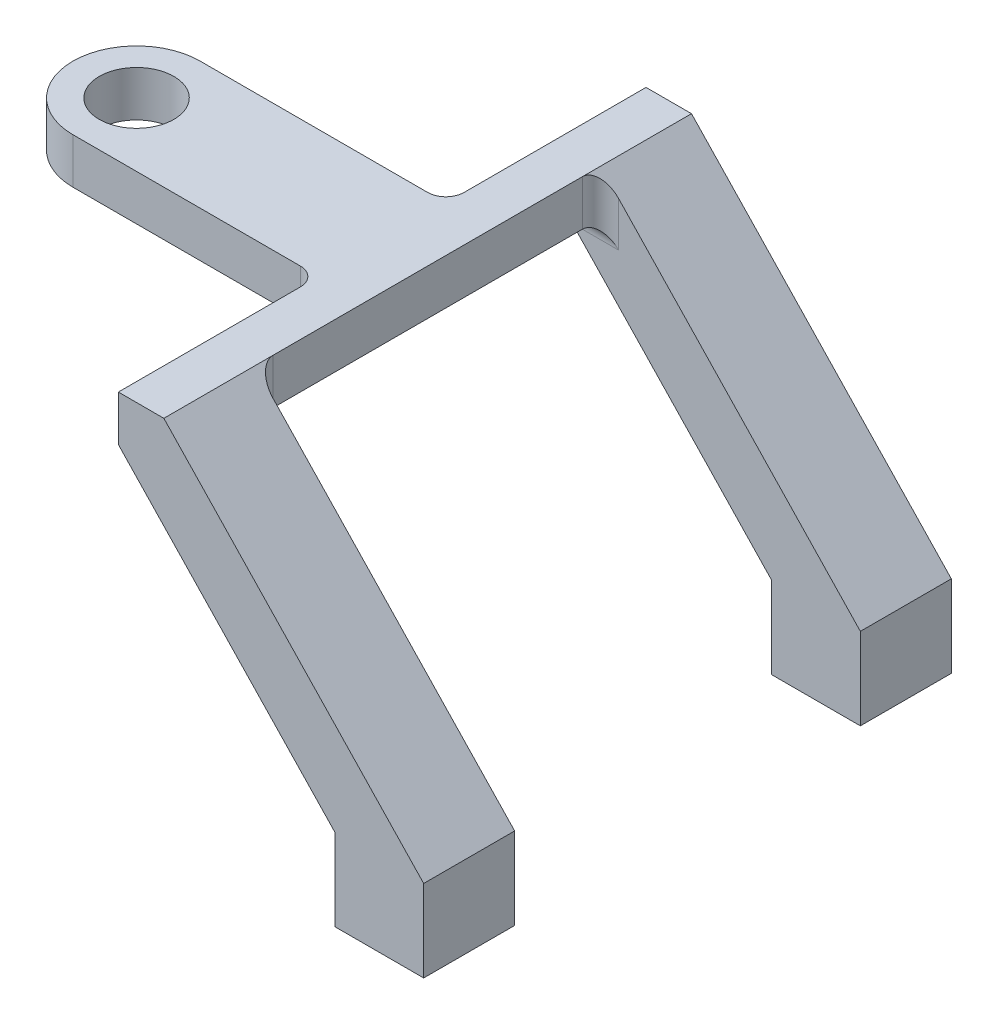
ISO-10303-21;
HEADER;
FILE_DESCRIPTION(('STEP AP214'),'2;1');
FILE_NAME('part.step','',(''),(''),'','','');
FILE_SCHEMA(('AUTOMOTIVE_DESIGN { 1 0 10303 214 1 1 1 1 }'));
ENDSEC;
DATA;
#1=APPLICATION_CONTEXT('core data for automotive mechanical design processes');
#2=APPLICATION_PROTOCOL_DEFINITION('international standard','automotive_design',2000,#1);
#3=PRODUCT_CONTEXT('',#1,'mechanical');
#4=PRODUCT('Part','Part','',(#3));
#5=PRODUCT_RELATED_PRODUCT_CATEGORY('part','',(#4));
#6=PRODUCT_DEFINITION_FORMATION('','',#4);
#7=PRODUCT_DEFINITION_CONTEXT('part definition',#1,'design');
#8=PRODUCT_DEFINITION('design','',#6,#7);
#9=PRODUCT_DEFINITION_SHAPE('','',#8);
#10=(LENGTH_UNIT() NAMED_UNIT(*) SI_UNIT(.MILLI.,.METRE.));
#11=(NAMED_UNIT(*) PLANE_ANGLE_UNIT() SI_UNIT($,.RADIAN.));
#12=(NAMED_UNIT(*) SI_UNIT($,.STERADIAN.) SOLID_ANGLE_UNIT());
#13=UNCERTAINTY_MEASURE_WITH_UNIT(LENGTH_MEASURE(1.E-05),#10,'distance_accuracy_value','');
#14=(GEOMETRIC_REPRESENTATION_CONTEXT(3) GLOBAL_UNCERTAINTY_ASSIGNED_CONTEXT((#13)) GLOBAL_UNIT_ASSIGNED_CONTEXT((#10,
#11,#12)) REPRESENTATION_CONTEXT('',''));
#15=CARTESIAN_POINT('',(0.,0.,0.));
#16=DIRECTION('',(0.,0.,1.));
#17=DIRECTION('',(1.,0.,0.));
#18=AXIS2_PLACEMENT_3D('',#15,#16,#17);
#19=CARTESIAN_POINT('',(-42.6212,43.18,12.7));
#20=DIRECTION('',(1.,0.,0.));
#21=DIRECTION('',(0.,0.,-1.));
#22=AXIS2_PLACEMENT_3D('',#19,#20,#21);
#23=PLANE('',#22);
#24=DIRECTION('',(0.,0.,-1.));
#25=VECTOR('',#24,1.);
#26=CARTESIAN_POINT('',(-42.6212,49.53,12.7));
#27=LINE('',#26,#25);
#28=CARTESIAN_POINT('',(-42.6212,49.53,73.66));
#29=VERTEX_POINT('',#28);
#30=CARTESIAN_POINT('',(-42.6212,49.53,48.26));
#31=VERTEX_POINT('',#30);
#32=EDGE_CURVE('E427',#29,#31,#27,.T.);
#33=ORIENTED_EDGE('',*,*,#32,.T.);
#34=DIRECTION('',(0.,1.,0.));
#35=VECTOR('',#34,1.);
#36=CARTESIAN_POINT('',(-42.6212,43.18,48.26));
#37=LINE('',#36,#35);
#38=CARTESIAN_POINT('',(-42.6212,43.18,48.26));
#39=VERTEX_POINT('',#38);
#40=EDGE_CURVE('E458',#31,#39,#37,.F.);
#41=ORIENTED_EDGE('',*,*,#40,.T.);
#42=DIRECTION('',(0.,0.,-1.));
#43=VECTOR('',#42,1.);
#44=CARTESIAN_POINT('',(-42.6212,43.18,60.96));
#45=LINE('',#44,#43);
#46=CARTESIAN_POINT('',(-42.6212,43.18,58.42));
#47=VERTEX_POINT('',#46);
#48=EDGE_CURVE('E372',#47,#39,#45,.T.);
#49=ORIENTED_EDGE('',*,*,#48,.F.);
#50=DIRECTION('',(0.,0.,-1.));
#51=VECTOR('',#50,1.);
#52=CARTESIAN_POINT('',(-42.6212,43.18,73.66));
#53=LINE('',#52,#51);
#54=CARTESIAN_POINT('',(-42.6212,43.18,73.66));
#55=VERTEX_POINT('',#54);
#56=EDGE_CURVE('E81',#55,#47,#53,.T.);
#57=ORIENTED_EDGE('',*,*,#56,.F.);
#58=DIRECTION('',(0.,-1.,0.));
#59=VECTOR('',#58,1.);
#60=CARTESIAN_POINT('',(-42.6212,49.53,73.66));
#61=LINE('',#60,#59);
#62=EDGE_CURVE('E304',#29,#55,#61,.T.);
#63=ORIENTED_EDGE('',*,*,#62,.F.);
#64=EDGE_LOOP('',(#33,#41,#49,#57,#63));
#65=FACE_BOUND('',#64,.T.);
#66=ADVANCED_FACE('F39',(#65),#23,.F.);
#67=CARTESIAN_POINT('',(0.,0.,12.7));
#68=DIRECTION('',(0.,0.,-1.));
#69=DIRECTION('',(-1.,0.,0.));
#70=AXIS2_PLACEMENT_3D('',#67,#68,#69);
#71=PLANE('',#70);
#72=DIRECTION('',(-0.689510475747819,0.724275709819138,0.));
#73=VECTOR('',#72,1.);
#74=CARTESIAN_POINT('',(-36.2712,49.53,12.7));
#75=LINE('',#74,#73);
#76=CARTESIAN_POINT('',(0.,11.43,12.7));
#77=VERTEX_POINT('',#76);
#78=CARTESIAN_POINT('',(-33.7312,46.8619327731092,12.7));
#79=VERTEX_POINT('',#78);
#80=EDGE_CURVE('E377',#77,#79,#75,.T.);
#81=ORIENTED_EDGE('',*,*,#80,.T.);
#82=DIRECTION('',(0.,1.,0.));
#83=VECTOR('',#82,1.);
#84=CARTESIAN_POINT('',(-33.7312,43.18,12.7));
#85=LINE('',#84,#83);
#86=CARTESIAN_POINT('',(-33.7312,40.64,12.7));
#87=VERTEX_POINT('',#86);
#88=EDGE_CURVE('E448',#79,#87,#85,.F.);
#89=ORIENTED_EDGE('',*,*,#88,.T.);
#90=DIRECTION('',(1.,0.,0.));
#91=VECTOR('',#90,1.);
#92=CARTESIAN_POINT('',(-42.6212,40.64,12.7));
#93=LINE('',#92,#91);
#94=CARTESIAN_POINT('',(-40.20312,40.64,12.7));
#95=VERTEX_POINT('',#94);
#96=EDGE_CURVE('E445',#87,#95,#93,.F.);
#97=ORIENTED_EDGE('',*,*,#96,.T.);
#98=DIRECTION('',(0.689510475747819,-0.724275709819138,0.));
#99=VECTOR('',#98,1.);
#100=CARTESIAN_POINT('',(-12.3952,11.43,12.7));
#101=LINE('',#100,#99);
#102=CARTESIAN_POINT('',(-12.3952,11.43,12.7));
#103=VERTEX_POINT('',#102);
#104=EDGE_CURVE('E382',#95,#103,#101,.T.);
#105=ORIENTED_EDGE('',*,*,#104,.T.);
#106=DIRECTION('',(0.,-1.,0.));
#107=VECTOR('',#106,1.);
#108=CARTESIAN_POINT('',(-12.3952,0.,12.7));
#109=LINE('',#108,#107);
#110=CARTESIAN_POINT('',(-12.3952,0.,12.7));
#111=VERTEX_POINT('',#110);
#112=EDGE_CURVE('E385',#103,#111,#109,.T.);
#113=ORIENTED_EDGE('',*,*,#112,.T.);
#114=DIRECTION('',(1.,0.,0.));
#115=VECTOR('',#114,1.);
#116=CARTESIAN_POINT('',(0.,0.,12.7));
#117=LINE('',#116,#115);
#118=CARTESIAN_POINT('',(0.,0.,12.7));
#119=VERTEX_POINT('',#118);
#120=EDGE_CURVE('E388',#111,#119,#117,.T.);
#121=ORIENTED_EDGE('',*,*,#120,.T.);
#122=DIRECTION('',(0.,1.,0.));
#123=VECTOR('',#122,1.);
#124=CARTESIAN_POINT('',(0.,11.43,12.7));
#125=LINE('',#124,#123);
#126=EDGE_CURVE('E373',#119,#77,#125,.T.);
#127=ORIENTED_EDGE('',*,*,#126,.T.);
#128=EDGE_LOOP('',(#81,#89,#97,#105,#113,#121,#127));
#129=FACE_BOUND('',#128,.T.);
#130=ADVANCED_FACE('F493',(#129),#71,.F.);
#131=CARTESIAN_POINT('',(0.,11.43,12.7));
#132=DIRECTION('',(-1.,0.,0.));
#133=DIRECTION('',(0.,-1.,0.));
#134=AXIS2_PLACEMENT_3D('',#131,#132,#133);
#135=PLANE('',#134);
#136=DIRECTION('',(0.,1.,0.));
#137=VECTOR('',#136,1.);
#138=CARTESIAN_POINT('',(0.,11.43,0.));
#139=LINE('',#138,#137);
#140=CARTESIAN_POINT('',(0.,0.,0.));
#141=VERTEX_POINT('',#140);
#142=CARTESIAN_POINT('',(0.,11.43,0.));
#143=VERTEX_POINT('',#142);
#144=EDGE_CURVE('E392',#141,#143,#139,.T.);
#145=ORIENTED_EDGE('',*,*,#144,.T.);
#146=DIRECTION('',(0.,0.,-1.));
#147=VECTOR('',#146,1.);
#148=CARTESIAN_POINT('',(0.,11.43,12.7));
#149=LINE('',#148,#147);
#150=EDGE_CURVE('E435',#77,#143,#149,.T.);
#151=ORIENTED_EDGE('',*,*,#150,.F.);
#152=ORIENTED_EDGE('',*,*,#126,.F.);
#153=DIRECTION('',(0.,0.,-1.));
#154=VECTOR('',#153,1.);
#155=CARTESIAN_POINT('',(0.,0.,12.7));
#156=LINE('',#155,#154);
#157=EDGE_CURVE('E391',#119,#141,#156,.T.);
#158=ORIENTED_EDGE('',*,*,#157,.T.);
#159=EDGE_LOOP('',(#145,#151,#152,#158));
#160=FACE_BOUND('',#159,.T.);
#161=ADVANCED_FACE('F500',(#160),#135,.F.);
#162=CARTESIAN_POINT('',(-36.2712,49.53,12.7));
#163=DIRECTION('',(-0.724275709819138,-0.689510475747819,0.));
#164=DIRECTION('',(0.689510475747819,-0.724275709819138,0.));
#165=AXIS2_PLACEMENT_3D('',#162,#163,#164);
#166=PLANE('',#165);
#167=DIRECTION('',(-0.689510475747819,0.724275709819138,0.));
#168=VECTOR('',#167,1.);
#169=CARTESIAN_POINT('',(-36.2712,49.53,0.));
#170=LINE('',#169,#168);
#171=CARTESIAN_POINT('',(-36.2712,49.53,0.));
#172=VERTEX_POINT('',#171);
#173=EDGE_CURVE('E396',#143,#172,#170,.T.);
#174=ORIENTED_EDGE('',*,*,#173,.T.);
#175=DIRECTION('',(0.,0.,-1.));
#176=VECTOR('',#175,1.);
#177=CARTESIAN_POINT('',(-36.2712,49.53,12.7));
#178=LINE('',#177,#176);
#179=CARTESIAN_POINT('',(-36.2712,49.53,15.24));
#180=VERTEX_POINT('',#179);
#181=EDGE_CURVE('E431',#180,#172,#178,.T.);
#182=ORIENTED_EDGE('',*,*,#181,.F.);
#183=CARTESIAN_POINT('',(-33.7312,46.8619327731092,15.24));
#184=DIRECTION('',(-0.724275709819138,-0.689510475747819,0.));
#185=DIRECTION('',(0.689510475747819,-0.724275709819138,0.));
#186=AXIS2_PLACEMENT_3D('',#183,#184,#185);
#187=ELLIPSE('',#186,3.68377289300094,2.54);
#188=EDGE_CURVE('E467',#180,#79,#187,.T.);
#189=ORIENTED_EDGE('',*,*,#188,.T.);
#190=ORIENTED_EDGE('',*,*,#80,.F.);
#191=ORIENTED_EDGE('',*,*,#150,.T.);
#192=EDGE_LOOP('',(#174,#182,#189,#190,#191));
#193=FACE_BOUND('',#192,.T.);
#194=ADVANCED_FACE('F513',(#193),#166,.F.);
#195=CARTESIAN_POINT('',(-42.6212,49.53,12.7));
#196=DIRECTION('',(0.,-1.,0.));
#197=DIRECTION('',(1.,0.,0.));
#198=AXIS2_PLACEMENT_3D('',#195,#196,#197);
#199=PLANE('',#198);
#200=DIRECTION('',(-1.,0.,0.));
#201=VECTOR('',#200,1.);
#202=CARTESIAN_POINT('',(-42.6212,49.53,0.));
#203=LINE('',#202,#201);
#204=CARTESIAN_POINT('',(-42.6212,49.53,0.));
#205=VERTEX_POINT('',#204);
#206=EDGE_CURVE('E399',#172,#205,#203,.T.);
#207=ORIENTED_EDGE('',*,*,#206,.T.);
#208=CARTESIAN_POINT('',(-42.6212,49.53,25.4));
#209=VERTEX_POINT('',#208);
#210=EDGE_CURVE('E426',#209,#205,#27,.T.);
#211=ORIENTED_EDGE('',*,*,#210,.F.);
#212=CARTESIAN_POINT('',(-45.1612,49.53,25.4));
#213=DIRECTION('',(0.,-1.,0.));
#214=DIRECTION('',(1.,0.,0.));
#215=AXIS2_PLACEMENT_3D('',#212,#213,#214);
#216=CIRCLE('',#215,2.54);
#217=CARTESIAN_POINT('',(-45.1612,49.53,27.94));
#218=VERTEX_POINT('',#217);
#219=EDGE_CURVE('E143',#209,#218,#216,.T.);
#220=ORIENTED_EDGE('',*,*,#219,.T.);
#221=DIRECTION('',(-1.,0.,0.));
#222=VECTOR('',#221,1.);
#223=CARTESIAN_POINT('',(-42.6212,49.53,27.94));
#224=LINE('',#223,#222);
#225=CARTESIAN_POINT('',(-76.9112,49.53,27.94));
#226=VERTEX_POINT('',#225);
#227=EDGE_CURVE('E119',#218,#226,#224,.T.);
#228=ORIENTED_EDGE('',*,*,#227,.T.);
#229=CARTESIAN_POINT('',(-76.9112,49.53,36.83));
#230=DIRECTION('',(0.,1.,0.));
#231=DIRECTION('',(-1.,0.,0.));
#232=AXIS2_PLACEMENT_3D('',#229,#230,#231);
#233=CIRCLE('',#232,8.89);
#234=CARTESIAN_POINT('',(-76.9112,49.53,45.72));
#235=VERTEX_POINT('',#234);
#236=EDGE_CURVE('E280',#226,#235,#233,.T.);
#237=ORIENTED_EDGE('',*,*,#236,.T.);
#238=DIRECTION('',(1.,0.,0.));
#239=VECTOR('',#238,1.);
#240=CARTESIAN_POINT('',(-76.9112,49.53,45.72));
#241=LINE('',#240,#239);
#242=CARTESIAN_POINT('',(-45.1612,49.53,45.72));
#243=VERTEX_POINT('',#242);
#244=EDGE_CURVE('E289',#235,#243,#241,.T.);
#245=ORIENTED_EDGE('',*,*,#244,.T.);
#246=CARTESIAN_POINT('',(-45.1612,49.53,48.26));
#247=DIRECTION('',(0.,-1.,0.));
#248=DIRECTION('',(1.,0.,0.));
#249=AXIS2_PLACEMENT_3D('',#246,#247,#248);
#250=CIRCLE('',#249,2.54);
#251=EDGE_CURVE('E93',#243,#31,#250,.T.);
#252=ORIENTED_EDGE('',*,*,#251,.T.);
#253=ORIENTED_EDGE('',*,*,#32,.F.);
#254=DIRECTION('',(-1.,0.,0.));
#255=VECTOR('',#254,1.);
#256=CARTESIAN_POINT('',(-36.2712,49.53,73.66));
#257=LINE('',#256,#255);
#258=CARTESIAN_POINT('',(-36.2712,49.53,73.66));
#259=VERTEX_POINT('',#258);
#260=EDGE_CURVE('E324',#259,#29,#257,.T.);
#261=ORIENTED_EDGE('',*,*,#260,.F.);
#262=DIRECTION('',(0.,0.,-1.));
#263=VECTOR('',#262,1.);
#264=CARTESIAN_POINT('',(-36.2712,49.53,73.66));
#265=LINE('',#264,#263);
#266=CARTESIAN_POINT('',(-36.2712,49.53,58.42));
#267=VERTEX_POINT('',#266);
#268=EDGE_CURVE('E66',#259,#267,#265,.T.);
#269=ORIENTED_EDGE('',*,*,#268,.T.);
#270=DIRECTION('',(0.,0.,-1.));
#271=VECTOR('',#270,1.);
#272=CARTESIAN_POINT('',(-36.2712,49.53,60.96));
#273=LINE('',#272,#271);
#274=EDGE_CURVE('E362',#267,#180,#273,.T.);
#275=ORIENTED_EDGE('',*,*,#274,.T.);
#276=ORIENTED_EDGE('',*,*,#181,.T.);
#277=EDGE_LOOP('',(#207,#211,#220,#228,#237,#245,#252,#253,#261,#269,#275,#276));
#278=FACE_BOUND('',#277,.T.);
#279=CARTESIAN_POINT('',(-76.9112,49.53,36.83));
#280=DIRECTION('',(0.,1.,0.));
#281=DIRECTION('',(-1.,0.,0.));
#282=AXIS2_PLACEMENT_3D('',#279,#280,#281);
#283=CIRCLE('',#282,5.20700000000001);
#284=CARTESIAN_POINT('',(-82.1182,49.53,36.83));
#285=VERTEX_POINT('',#284);
#286=EDGE_CURVE('E154',#285,#285,#283,.T.);
#287=ORIENTED_EDGE('',*,*,#286,.F.);
#288=EDGE_LOOP('',(#287));
#289=FACE_BOUND('',#288,.T.);
#290=ADVANCED_FACE('F276',(#278,#289),#199,.F.);
#291=CARTESIAN_POINT('',(-42.6212,43.18,25.4));
#292=VERTEX_POINT('',#291);
#293=CARTESIAN_POINT('',(-42.6212,43.18,15.24));
#294=VERTEX_POINT('',#293);
#295=EDGE_CURVE('E369',#292,#294,#45,.T.);
#296=ORIENTED_EDGE('',*,*,#295,.F.);
#297=DIRECTION('',(0.,1.,0.));
#298=VECTOR('',#297,1.);
#299=CARTESIAN_POINT('',(-42.6212,43.18,25.4));
#300=LINE('',#299,#298);
#301=EDGE_CURVE('E124',#292,#209,#300,.T.);
#302=ORIENTED_EDGE('',*,*,#301,.T.);
#303=ORIENTED_EDGE('',*,*,#210,.T.);
#304=DIRECTION('',(0.,-1.,0.));
#305=VECTOR('',#304,1.);
#306=CARTESIAN_POINT('',(-42.6212,43.18,0.));
#307=LINE('',#306,#305);
#308=CARTESIAN_POINT('',(-42.6212,43.18,0.));
#309=VERTEX_POINT('',#308);
#310=EDGE_CURVE('E402',#205,#309,#307,.T.);
#311=ORIENTED_EDGE('',*,*,#310,.T.);
#312=DIRECTION('',(0.,0.,-1.));
#313=VECTOR('',#312,1.);
#314=CARTESIAN_POINT('',(-42.6212,43.18,12.7));
#315=LINE('',#314,#313);
#316=EDGE_CURVE('E57',#294,#309,#315,.T.);
#317=ORIENTED_EDGE('',*,*,#316,.F.);
#318=EDGE_LOOP('',(#296,#302,#303,#311,#317));
#319=FACE_BOUND('',#318,.T.);
#320=ADVANCED_FACE('F496',(#319),#23,.F.);
#321=CARTESIAN_POINT('',(-12.3952,11.43,12.7));
#322=DIRECTION('',(0.724275709819138,0.689510475747819,0.));
#323=DIRECTION('',(-0.689510475747819,0.724275709819138,0.));
#324=AXIS2_PLACEMENT_3D('',#321,#322,#323);
#325=PLANE('',#324);
#326=DIRECTION('',(0.689510475747819,-0.724275709819138,0.));
#327=VECTOR('',#326,1.);
#328=CARTESIAN_POINT('',(-12.3952,11.43,0.));
#329=LINE('',#328,#327);
#330=CARTESIAN_POINT('',(-12.3952,11.43,0.));
#331=VERTEX_POINT('',#330);
#332=EDGE_CURVE('E405',#309,#331,#329,.T.);
#333=ORIENTED_EDGE('',*,*,#332,.T.);
#334=DIRECTION('',(0.,0.,-1.));
#335=VECTOR('',#334,1.);
#336=CARTESIAN_POINT('',(-12.3952,11.43,12.7));
#337=LINE('',#336,#335);
#338=EDGE_CURVE('E420',#103,#331,#337,.T.);
#339=ORIENTED_EDGE('',*,*,#338,.F.);
#340=ORIENTED_EDGE('',*,*,#104,.F.);
#341=CARTESIAN_POINT('',(-40.20312,40.64,15.24));
#342=DIRECTION('',(0.724275709819138,0.689510475747819,0.));
#343=DIRECTION('',(-0.689510475747819,0.724275709819138,0.));
#344=AXIS2_PLACEMENT_3D('',#341,#342,#343);
#345=ELLIPSE('',#344,3.5069517941369,2.54);
#346=EDGE_CURVE('E11',#95,#294,#345,.T.);
#347=ORIENTED_EDGE('',*,*,#346,.T.);
#348=ORIENTED_EDGE('',*,*,#316,.T.);
#349=EDGE_LOOP('',(#333,#339,#340,#347,#348));
#350=FACE_BOUND('',#349,.T.);
#351=ADVANCED_FACE('F506',(#350),#325,.F.);
#352=CARTESIAN_POINT('',(-12.3952,0.,12.7));
#353=DIRECTION('',(1.,0.,0.));
#354=DIRECTION('',(0.,1.,0.));
#355=AXIS2_PLACEMENT_3D('',#352,#353,#354);
#356=PLANE('',#355);
#357=DIRECTION('',(0.,-1.,0.));
#358=VECTOR('',#357,1.);
#359=CARTESIAN_POINT('',(-12.3952,0.,0.));
#360=LINE('',#359,#358);
#361=CARTESIAN_POINT('',(-12.3952,0.,0.));
#362=VERTEX_POINT('',#361);
#363=EDGE_CURVE('E408',#331,#362,#360,.T.);
#364=ORIENTED_EDGE('',*,*,#363,.T.);
#365=DIRECTION('',(0.,0.,-1.));
#366=VECTOR('',#365,1.);
#367=CARTESIAN_POINT('',(-12.3952,0.,12.7));
#368=LINE('',#367,#366);
#369=EDGE_CURVE('E416',#111,#362,#368,.T.);
#370=ORIENTED_EDGE('',*,*,#369,.F.);
#371=ORIENTED_EDGE('',*,*,#112,.F.);
#372=ORIENTED_EDGE('',*,*,#338,.T.);
#373=EDGE_LOOP('',(#364,#370,#371,#372));
#374=FACE_BOUND('',#373,.T.);
#375=ADVANCED_FACE('F511',(#374),#356,.F.);
#376=CARTESIAN_POINT('',(0.,0.,12.7));
#377=DIRECTION('',(0.,1.,0.));
#378=DIRECTION('',(0.,0.,1.));
#379=AXIS2_PLACEMENT_3D('',#376,#377,#378);
#380=PLANE('',#379);
#381=DIRECTION('',(1.,0.,0.));
#382=VECTOR('',#381,1.);
#383=CARTESIAN_POINT('',(0.,0.,0.));
#384=LINE('',#383,#382);
#385=EDGE_CURVE('E378',#362,#141,#384,.T.);
#386=ORIENTED_EDGE('',*,*,#385,.T.);
#387=ORIENTED_EDGE('',*,*,#157,.F.);
#388=ORIENTED_EDGE('',*,*,#120,.F.);
#389=ORIENTED_EDGE('',*,*,#369,.T.);
#390=EDGE_LOOP('',(#386,#387,#388,#389));
#391=FACE_BOUND('',#390,.T.);
#392=ADVANCED_FACE('F548',(#391),#380,.F.);
#393=CARTESIAN_POINT('',(0.,0.,0.));
#394=DIRECTION('',(0.,0.,-1.));
#395=DIRECTION('',(-1.,0.,0.));
#396=AXIS2_PLACEMENT_3D('',#393,#394,#395);
#397=PLANE('',#396);
#398=ORIENTED_EDGE('',*,*,#144,.F.);
#399=ORIENTED_EDGE('',*,*,#385,.F.);
#400=ORIENTED_EDGE('',*,*,#363,.F.);
#401=ORIENTED_EDGE('',*,*,#332,.F.);
#402=ORIENTED_EDGE('',*,*,#310,.F.);
#403=ORIENTED_EDGE('',*,*,#206,.F.);
#404=ORIENTED_EDGE('',*,*,#173,.F.);
#405=EDGE_LOOP('',(#398,#399,#400,#401,#402,#403,#404));
#406=FACE_BOUND('',#405,.T.);
#407=ADVANCED_FACE('F532',(#406),#397,.T.);
#408=CARTESIAN_POINT('',(-42.6212,43.18,60.96));
#409=DIRECTION('',(0.,1.,0.));
#410=DIRECTION('',(0.,0.,1.));
#411=AXIS2_PLACEMENT_3D('',#408,#409,#410);
#412=PLANE('',#411);
#413=DIRECTION('',(0.,0.,-1.));
#414=VECTOR('',#413,1.);
#415=CARTESIAN_POINT('',(-36.2712,43.18,60.96));
#416=LINE('',#415,#414);
#417=CARTESIAN_POINT('',(-36.2712,43.18,58.42));
#418=VERTEX_POINT('',#417);
#419=CARTESIAN_POINT('',(-36.2712,43.18,15.24));
#420=VERTEX_POINT('',#419);
#421=EDGE_CURVE('E365',#418,#420,#416,.T.);
#422=ORIENTED_EDGE('',*,*,#421,.F.);
#423=DIRECTION('',(1.,0.,0.));
#424=VECTOR('',#423,1.);
#425=CARTESIAN_POINT('',(-42.6212,43.18,58.42));
#426=LINE('',#425,#424);
#427=EDGE_CURVE('E186',#418,#47,#426,.F.);
#428=ORIENTED_EDGE('',*,*,#427,.T.);
#429=ORIENTED_EDGE('',*,*,#48,.T.);
#430=CARTESIAN_POINT('',(-45.1612,43.18,48.26));
#431=DIRECTION('',(0.,1.,0.));
#432=DIRECTION('',(0.,0.,1.));
#433=AXIS2_PLACEMENT_3D('',#430,#431,#432);
#434=CIRCLE('',#433,2.54);
#435=CARTESIAN_POINT('',(-45.1612,43.18,45.72));
#436=VERTEX_POINT('',#435);
#437=EDGE_CURVE('E148',#39,#436,#434,.T.);
#438=ORIENTED_EDGE('',*,*,#437,.T.);
#439=DIRECTION('',(-1.,0.,0.));
#440=VECTOR('',#439,1.);
#441=CARTESIAN_POINT('',(-76.9112000000001,43.18,45.72));
#442=LINE('',#441,#440);
#443=CARTESIAN_POINT('',(-76.9112,43.18,45.72));
#444=VERTEX_POINT('',#443);
#445=EDGE_CURVE('E138',#436,#444,#442,.T.);
#446=ORIENTED_EDGE('',*,*,#445,.T.);
#447=CARTESIAN_POINT('',(-76.9112,43.18,36.83));
#448=DIRECTION('',(0.,1.,0.));
#449=DIRECTION('',(0.,0.,1.));
#450=AXIS2_PLACEMENT_3D('',#447,#448,#449);
#451=CIRCLE('',#450,8.89);
#452=CARTESIAN_POINT('',(-76.9112,43.18,27.94));
#453=VERTEX_POINT('',#452);
#454=EDGE_CURVE('E134',#444,#453,#451,.F.);
#455=ORIENTED_EDGE('',*,*,#454,.T.);
#456=DIRECTION('',(1.,0.,0.));
#457=VECTOR('',#456,1.);
#458=CARTESIAN_POINT('',(-42.6212000000001,43.18,27.94));
#459=LINE('',#458,#457);
#460=CARTESIAN_POINT('',(-45.1612,43.18,27.94));
#461=VERTEX_POINT('',#460);
#462=EDGE_CURVE('E117',#453,#461,#459,.T.);
#463=ORIENTED_EDGE('',*,*,#462,.T.);
#464=CARTESIAN_POINT('',(-45.1612,43.18,25.4));
#465=DIRECTION('',(0.,1.,0.));
#466=DIRECTION('',(0.,0.,1.));
#467=AXIS2_PLACEMENT_3D('',#464,#465,#466);
#468=CIRCLE('',#467,2.54);
#469=EDGE_CURVE('E131',#461,#292,#468,.T.);
#470=ORIENTED_EDGE('',*,*,#469,.T.);
#471=ORIENTED_EDGE('',*,*,#295,.T.);
#472=DIRECTION('',(1.,0.,0.));
#473=VECTOR('',#472,1.);
#474=CARTESIAN_POINT('',(-36.2712,43.18,15.24));
#475=LINE('',#474,#473);
#476=EDGE_CURVE('E123',#294,#420,#475,.T.);
#477=ORIENTED_EDGE('',*,*,#476,.T.);
#478=EDGE_LOOP('',(#422,#428,#429,#438,#446,#455,#463,#470,#471,#477));
#479=FACE_BOUND('',#478,.T.);
#480=CARTESIAN_POINT('',(-76.9112,43.18,36.83));
#481=DIRECTION('',(0.,1.,0.));
#482=DIRECTION('',(0.,0.,1.));
#483=AXIS2_PLACEMENT_3D('',#480,#481,#482);
#484=CIRCLE('',#483,5.20700000000001);
#485=CARTESIAN_POINT('',(-76.9112,43.18,42.037));
#486=VERTEX_POINT('',#485);
#487=EDGE_CURVE('E137',#486,#486,#484,.F.);
#488=ORIENTED_EDGE('',*,*,#487,.F.);
#489=EDGE_LOOP('',(#488));
#490=FACE_BOUND('',#489,.T.);
#491=ADVANCED_FACE('F129',(#479,#490),#412,.F.);
#492=CARTESIAN_POINT('',(-36.2712,49.53,60.96));
#493=DIRECTION('',(-1.,0.,0.));
#494=DIRECTION('',(0.,0.,1.));
#495=AXIS2_PLACEMENT_3D('',#492,#493,#494);
#496=PLANE('',#495);
#497=ORIENTED_EDGE('',*,*,#421,.T.);
#498=DIRECTION('',(0.,1.,0.));
#499=VECTOR('',#498,1.);
#500=CARTESIAN_POINT('',(-36.2712,49.53,15.24));
#501=LINE('',#500,#499);
#502=EDGE_CURVE('E441',#420,#180,#501,.T.);
#503=ORIENTED_EDGE('',*,*,#502,.T.);
#504=ORIENTED_EDGE('',*,*,#274,.F.);
#505=DIRECTION('',(0.,1.,0.));
#506=VECTOR('',#505,1.);
#507=CARTESIAN_POINT('',(-36.2712,43.18,58.42));
#508=LINE('',#507,#506);
#509=EDGE_CURVE('E173',#267,#418,#508,.F.);
#510=ORIENTED_EDGE('',*,*,#509,.T.);
#511=EDGE_LOOP('',(#497,#503,#504,#510));
#512=FACE_BOUND('',#511,.T.);
#513=ADVANCED_FACE('F525',(#512),#496,.F.);
#514=CARTESIAN_POINT('',(0.,0.,60.96));
#515=DIRECTION('',(0.,0.,1.));
#516=DIRECTION('',(1.,0.,0.));
#517=AXIS2_PLACEMENT_3D('',#514,#515,#516);
#518=PLANE('',#517);
#519=DIRECTION('',(1.,0.,0.));
#520=VECTOR('',#519,1.);
#521=CARTESIAN_POINT('',(-36.2712,40.64,60.96));
#522=LINE('',#521,#520);
#523=CARTESIAN_POINT('',(-40.20312,40.64,60.96));
#524=VERTEX_POINT('',#523);
#525=CARTESIAN_POINT('',(-33.7312,40.64,60.96));
#526=VERTEX_POINT('',#525);
#527=EDGE_CURVE('E185',#524,#526,#522,.T.);
#528=ORIENTED_EDGE('',*,*,#527,.T.);
#529=DIRECTION('',(0.,1.,0.));
#530=VECTOR('',#529,1.);
#531=CARTESIAN_POINT('',(-33.7312,49.53,60.96));
#532=LINE('',#531,#530);
#533=CARTESIAN_POINT('',(-33.7312,46.8619327731092,60.96));
#534=VERTEX_POINT('',#533);
#535=EDGE_CURVE('E175',#526,#534,#532,.T.);
#536=ORIENTED_EDGE('',*,*,#535,.T.);
#537=DIRECTION('',(-0.689510475747819,0.724275709819138,0.));
#538=VECTOR('',#537,1.);
#539=CARTESIAN_POINT('',(0.,11.43,60.96));
#540=LINE('',#539,#538);
#541=CARTESIAN_POINT('',(0.,11.43,60.96));
#542=VERTEX_POINT('',#541);
#543=EDGE_CURVE('E309',#542,#534,#540,.T.);
#544=ORIENTED_EDGE('',*,*,#543,.F.);
#545=DIRECTION('',(0.,1.,0.));
#546=VECTOR('',#545,1.);
#547=CARTESIAN_POINT('',(0.,0.,60.96));
#548=LINE('',#547,#546);
#549=CARTESIAN_POINT('',(0.,0.,60.96));
#550=VERTEX_POINT('',#549);
#551=EDGE_CURVE('E336',#550,#542,#548,.T.);
#552=ORIENTED_EDGE('',*,*,#551,.F.);
#553=DIRECTION('',(1.,0.,0.));
#554=VECTOR('',#553,1.);
#555=CARTESIAN_POINT('',(-12.3952,0.,60.96));
#556=LINE('',#555,#554);
#557=CARTESIAN_POINT('',(-12.3952,0.,60.96));
#558=VERTEX_POINT('',#557);
#559=EDGE_CURVE('E333',#558,#550,#556,.T.);
#560=ORIENTED_EDGE('',*,*,#559,.F.);
#561=DIRECTION('',(0.,-1.,0.));
#562=VECTOR('',#561,1.);
#563=CARTESIAN_POINT('',(-12.3952,11.43,60.96));
#564=LINE('',#563,#562);
#565=CARTESIAN_POINT('',(-12.3952,11.43,60.96));
#566=VERTEX_POINT('',#565);
#567=EDGE_CURVE('E330',#566,#558,#564,.T.);
#568=ORIENTED_EDGE('',*,*,#567,.F.);
#569=DIRECTION('',(0.689510475747819,-0.724275709819138,0.));
#570=VECTOR('',#569,1.);
#571=CARTESIAN_POINT('',(-42.6212,43.18,60.96));
#572=LINE('',#571,#570);
#573=EDGE_CURVE('E303',#524,#566,#572,.T.);
#574=ORIENTED_EDGE('',*,*,#573,.F.);
#575=EDGE_LOOP('',(#528,#536,#544,#552,#560,#568,#574));
#576=FACE_BOUND('',#575,.T.);
#577=ADVANCED_FACE('F562',(#576),#518,.F.);
#578=CARTESIAN_POINT('',(-42.6212,43.18,73.66));
#579=DIRECTION('',(0.724275709819138,0.689510475747819,0.));
#580=DIRECTION('',(-0.689510475747819,0.724275709819138,0.));
#581=AXIS2_PLACEMENT_3D('',#578,#579,#580);
#582=PLANE('',#581);
#583=ORIENTED_EDGE('',*,*,#56,.T.);
#584=CARTESIAN_POINT('',(-40.20312,40.64,58.42));
#585=DIRECTION('',(0.724275709819138,0.689510475747819,0.));
#586=DIRECTION('',(-0.689510475747819,0.724275709819138,0.));
#587=AXIS2_PLACEMENT_3D('',#584,#585,#586);
#588=ELLIPSE('',#587,3.5069517941369,2.54);
#589=EDGE_CURVE('E49',#47,#524,#588,.T.);
#590=ORIENTED_EDGE('',*,*,#589,.T.);
#591=ORIENTED_EDGE('',*,*,#573,.T.);
#592=DIRECTION('',(0.,0.,-1.));
#593=VECTOR('',#592,1.);
#594=CARTESIAN_POINT('',(-12.3952,11.43,73.66));
#595=LINE('',#594,#593);
#596=CARTESIAN_POINT('',(-12.3952,11.43,73.66));
#597=VERTEX_POINT('',#596);
#598=EDGE_CURVE('E356',#597,#566,#595,.T.);
#599=ORIENTED_EDGE('',*,*,#598,.F.);
#600=DIRECTION('',(0.689510475747819,-0.724275709819138,0.));
#601=VECTOR('',#600,1.);
#602=CARTESIAN_POINT('',(-42.6212,43.18,73.66));
#603=LINE('',#602,#601);
#604=EDGE_CURVE('E308',#55,#597,#603,.T.);
#605=ORIENTED_EDGE('',*,*,#604,.F.);
#606=EDGE_LOOP('',(#583,#590,#591,#599,#605));
#607=FACE_BOUND('',#606,.T.);
#608=ADVANCED_FACE('F563',(#607),#582,.F.);
#609=CARTESIAN_POINT('',(-12.3952,11.43,73.66));
#610=DIRECTION('',(1.,0.,0.));
#611=DIRECTION('',(0.,1.,0.));
#612=AXIS2_PLACEMENT_3D('',#609,#610,#611);
#613=PLANE('',#612);
#614=ORIENTED_EDGE('',*,*,#567,.T.);
#615=DIRECTION('',(0.,0.,-1.));
#616=VECTOR('',#615,1.);
#617=CARTESIAN_POINT('',(-12.3952,0.,73.66));
#618=LINE('',#617,#616);
#619=CARTESIAN_POINT('',(-12.3952,0.,73.66));
#620=VERTEX_POINT('',#619);
#621=EDGE_CURVE('E352',#620,#558,#618,.T.);
#622=ORIENTED_EDGE('',*,*,#621,.F.);
#623=DIRECTION('',(0.,-1.,0.));
#624=VECTOR('',#623,1.);
#625=CARTESIAN_POINT('',(-12.3952,11.43,73.66));
#626=LINE('',#625,#624);
#627=EDGE_CURVE('E312',#597,#620,#626,.T.);
#628=ORIENTED_EDGE('',*,*,#627,.F.);
#629=ORIENTED_EDGE('',*,*,#598,.T.);
#630=EDGE_LOOP('',(#614,#622,#628,#629));
#631=FACE_BOUND('',#630,.T.);
#632=ADVANCED_FACE('F566',(#631),#613,.F.);
#633=CARTESIAN_POINT('',(-12.3952,0.,73.66));
#634=DIRECTION('',(0.,1.,0.));
#635=DIRECTION('',(0.,0.,1.));
#636=AXIS2_PLACEMENT_3D('',#633,#634,#635);
#637=PLANE('',#636);
#638=ORIENTED_EDGE('',*,*,#559,.T.);
#639=DIRECTION('',(0.,0.,-1.));
#640=VECTOR('',#639,1.);
#641=CARTESIAN_POINT('',(0.,0.,73.66));
#642=LINE('',#641,#640);
#643=CARTESIAN_POINT('',(0.,0.,73.66));
#644=VERTEX_POINT('',#643);
#645=EDGE_CURVE('E348',#644,#550,#642,.T.);
#646=ORIENTED_EDGE('',*,*,#645,.F.);
#647=DIRECTION('',(1.,0.,0.));
#648=VECTOR('',#647,1.);
#649=CARTESIAN_POINT('',(-12.3952,0.,73.66));
#650=LINE('',#649,#648);
#651=EDGE_CURVE('E315',#620,#644,#650,.T.);
#652=ORIENTED_EDGE('',*,*,#651,.F.);
#653=ORIENTED_EDGE('',*,*,#621,.T.);
#654=EDGE_LOOP('',(#638,#646,#652,#653));
#655=FACE_BOUND('',#654,.T.);
#656=ADVANCED_FACE('F569',(#655),#637,.F.);
#657=CARTESIAN_POINT('',(0.,0.,73.66));
#658=DIRECTION('',(-1.,0.,0.));
#659=DIRECTION('',(0.,-1.,0.));
#660=AXIS2_PLACEMENT_3D('',#657,#658,#659);
#661=PLANE('',#660);
#662=ORIENTED_EDGE('',*,*,#551,.T.);
#663=DIRECTION('',(0.,0.,-1.));
#664=VECTOR('',#663,1.);
#665=CARTESIAN_POINT('',(0.,11.43,73.66));
#666=LINE('',#665,#664);
#667=CARTESIAN_POINT('',(0.,11.43,73.66));
#668=VERTEX_POINT('',#667);
#669=EDGE_CURVE('E344',#668,#542,#666,.T.);
#670=ORIENTED_EDGE('',*,*,#669,.F.);
#671=DIRECTION('',(0.,1.,0.));
#672=VECTOR('',#671,1.);
#673=CARTESIAN_POINT('',(0.,0.,73.66));
#674=LINE('',#673,#672);
#675=EDGE_CURVE('E318',#644,#668,#674,.T.);
#676=ORIENTED_EDGE('',*,*,#675,.F.);
#677=ORIENTED_EDGE('',*,*,#645,.T.);
#678=EDGE_LOOP('',(#662,#670,#676,#677));
#679=FACE_BOUND('',#678,.T.);
#680=ADVANCED_FACE('F573',(#679),#661,.F.);
#681=CARTESIAN_POINT('',(0.,11.43,73.66));
#682=DIRECTION('',(-0.724275709819138,-0.689510475747819,0.));
#683=DIRECTION('',(0.689510475747819,-0.724275709819138,0.));
#684=AXIS2_PLACEMENT_3D('',#681,#682,#683);
#685=PLANE('',#684);
#686=ORIENTED_EDGE('',*,*,#543,.T.);
#687=CARTESIAN_POINT('',(-33.7312,46.8619327731092,58.42));
#688=DIRECTION('',(-0.724275709819138,-0.689510475747819,0.));
#689=DIRECTION('',(0.689510475747819,-0.724275709819138,0.));
#690=AXIS2_PLACEMENT_3D('',#687,#688,#689);
#691=ELLIPSE('',#690,3.68377289300094,2.54);
#692=EDGE_CURVE('E470',#534,#267,#691,.T.);
#693=ORIENTED_EDGE('',*,*,#692,.T.);
#694=ORIENTED_EDGE('',*,*,#268,.F.);
#695=DIRECTION('',(-0.689510475747819,0.724275709819138,0.));
#696=VECTOR('',#695,1.);
#697=CARTESIAN_POINT('',(0.,11.43,73.66));
#698=LINE('',#697,#696);
#699=EDGE_CURVE('E321',#668,#259,#698,.T.);
#700=ORIENTED_EDGE('',*,*,#699,.F.);
#701=ORIENTED_EDGE('',*,*,#669,.T.);
#702=EDGE_LOOP('',(#686,#693,#694,#700,#701));
#703=FACE_BOUND('',#702,.T.);
#704=ADVANCED_FACE('F577',(#703),#685,.F.);
#705=CARTESIAN_POINT('',(0.,0.,73.66));
#706=DIRECTION('',(0.,0.,1.));
#707=DIRECTION('',(1.,0.,0.));
#708=AXIS2_PLACEMENT_3D('',#705,#706,#707);
#709=PLANE('',#708);
#710=ORIENTED_EDGE('',*,*,#62,.T.);
#711=ORIENTED_EDGE('',*,*,#604,.T.);
#712=ORIENTED_EDGE('',*,*,#627,.T.);
#713=ORIENTED_EDGE('',*,*,#651,.T.);
#714=ORIENTED_EDGE('',*,*,#675,.T.);
#715=ORIENTED_EDGE('',*,*,#699,.T.);
#716=ORIENTED_EDGE('',*,*,#260,.T.);
#717=EDGE_LOOP('',(#710,#711,#712,#713,#714,#715,#716));
#718=FACE_BOUND('',#717,.T.);
#719=ADVANCED_FACE('F581',(#718),#709,.T.);
#720=CARTESIAN_POINT('',(-42.6212000000001,-3.51733182955961,27.94));
#721=DIRECTION('',(0.,0.,-1.));
#722=DIRECTION('',(-1.,0.,0.));
#723=AXIS2_PLACEMENT_3D('',#720,#721,#722);
#724=PLANE('',#723);
#725=ORIENTED_EDGE('',*,*,#227,.F.);
#726=DIRECTION('',(0.,1.,0.));
#727=VECTOR('',#726,1.);
#728=CARTESIAN_POINT('',(-45.1612,-3.51733182955961,27.94));
#729=LINE('',#728,#727);
#730=EDGE_CURVE('E112',#218,#461,#729,.F.);
#731=ORIENTED_EDGE('',*,*,#730,.T.);
#732=ORIENTED_EDGE('',*,*,#462,.F.);
#733=DIRECTION('',(0.,1.,0.));
#734=VECTOR('',#733,1.);
#735=CARTESIAN_POINT('',(-76.9112000000001,-3.51733182955957,27.94));
#736=LINE('',#735,#734);
#737=EDGE_CURVE('E285',#453,#226,#736,.T.);
#738=ORIENTED_EDGE('',*,*,#737,.T.);
#739=EDGE_LOOP('',(#725,#731,#732,#738));
#740=FACE_BOUND('',#739,.T.);
#741=ADVANCED_FACE('F114',(#740),#724,.T.);
#742=CARTESIAN_POINT('',(-76.9112000000001,-3.51733182955957,36.83));
#743=DIRECTION('',(0.,1.,0.));
#744=DIRECTION('',(-1.,0.,0.));
#745=AXIS2_PLACEMENT_3D('',#742,#743,#744);
#746=CYLINDRICAL_SURFACE('',#745,8.89);
#747=ORIENTED_EDGE('',*,*,#454,.F.);
#748=DIRECTION('',(0.,1.,0.));
#749=VECTOR('',#748,1.);
#750=CARTESIAN_POINT('',(-76.9112000000001,-3.51733182955957,45.72));
#751=LINE('',#750,#749);
#752=EDGE_CURVE('E288',#444,#235,#751,.T.);
#753=ORIENTED_EDGE('',*,*,#752,.T.);
#754=ORIENTED_EDGE('',*,*,#236,.F.);
#755=ORIENTED_EDGE('',*,*,#737,.F.);
#756=EDGE_LOOP('',(#747,#753,#754,#755));
#757=FACE_BOUND('',#756,.T.);
#758=ADVANCED_FACE('F291',(#757),#746,.T.);
#759=CARTESIAN_POINT('',(-76.9112000000001,-3.51733182955957,45.72));
#760=DIRECTION('',(0.,0.,1.));
#761=DIRECTION('',(1.,0.,0.));
#762=AXIS2_PLACEMENT_3D('',#759,#760,#761);
#763=PLANE('',#762);
#764=ORIENTED_EDGE('',*,*,#445,.F.);
#765=DIRECTION('',(0.,1.,0.));
#766=VECTOR('',#765,1.);
#767=CARTESIAN_POINT('',(-45.1612,-3.51733182955957,45.72));
#768=LINE('',#767,#766);
#769=EDGE_CURVE('E455',#436,#243,#768,.T.);
#770=ORIENTED_EDGE('',*,*,#769,.T.);
#771=ORIENTED_EDGE('',*,*,#244,.F.);
#772=ORIENTED_EDGE('',*,*,#752,.F.);
#773=EDGE_LOOP('',(#764,#770,#771,#772));
#774=FACE_BOUND('',#773,.T.);
#775=ADVANCED_FACE('F481',(#774),#763,.T.);
#776=CARTESIAN_POINT('',(-76.9112000000001,-3.51733182955957,36.83));
#777=DIRECTION('',(0.,1.,0.));
#778=DIRECTION('',(-1.,0.,0.));
#779=AXIS2_PLACEMENT_3D('',#776,#777,#778);
#780=CYLINDRICAL_SURFACE('',#779,5.20700000000001);
#781=ORIENTED_EDGE('',*,*,#487,.T.);
#782=EDGE_LOOP('',(#781));
#783=FACE_BOUND('',#782,.T.);
#784=ORIENTED_EDGE('',*,*,#286,.T.);
#785=EDGE_LOOP('',(#784));
#786=FACE_BOUND('',#785,.T.);
#787=ADVANCED_FACE('F594',(#783,#786),#780,.F.);
#788=CARTESIAN_POINT('',(-42.6212,40.64,15.24));
#789=DIRECTION('',(-1.,0.,0.));
#790=DIRECTION('',(0.,0.,1.));
#791=AXIS2_PLACEMENT_3D('',#788,#789,#790);
#792=CYLINDRICAL_SURFACE('',#791,2.54);
#793=ORIENTED_EDGE('',*,*,#346,.F.);
#794=ORIENTED_EDGE('',*,*,#96,.F.);
#795=CARTESIAN_POINT('',(-33.7312,40.64,15.24));
#796=DIRECTION('',(-0.707106781186547,-0.707106781186547,0.));
#797=DIRECTION('',(-0.707106781186547,0.707106781186547,0.));
#798=AXIS2_PLACEMENT_3D('',#795,#796,#797);
#799=ELLIPSE('',#798,3.59210244842766,2.54);
#800=EDGE_CURVE('E151',#420,#87,#799,.T.);
#801=ORIENTED_EDGE('',*,*,#800,.F.);
#802=ORIENTED_EDGE('',*,*,#476,.F.);
#803=EDGE_LOOP('',(#793,#794,#801,#802));
#804=FACE_BOUND('',#803,.T.);
#805=ADVANCED_FACE('F521',(#804),#792,.F.);
#806=CARTESIAN_POINT('',(-33.7312,49.53,15.24));
#807=DIRECTION('',(0.,-1.,0.));
#808=DIRECTION('',(0.,0.,-1.));
#809=AXIS2_PLACEMENT_3D('',#806,#807,#808);
#810=CYLINDRICAL_SURFACE('',#809,2.54);
#811=ORIENTED_EDGE('',*,*,#800,.T.);
#812=ORIENTED_EDGE('',*,*,#88,.F.);
#813=ORIENTED_EDGE('',*,*,#188,.F.);
#814=ORIENTED_EDGE('',*,*,#502,.F.);
#815=EDGE_LOOP('',(#811,#812,#813,#814));
#816=FACE_BOUND('',#815,.T.);
#817=ADVANCED_FACE('F523',(#816),#810,.F.);
#818=CARTESIAN_POINT('',(0.,40.64,58.42));
#819=DIRECTION('',(-1.,0.,0.));
#820=DIRECTION('',(0.,0.,1.));
#821=AXIS2_PLACEMENT_3D('',#818,#819,#820);
#822=CYLINDRICAL_SURFACE('',#821,2.54);
#823=ORIENTED_EDGE('',*,*,#589,.F.);
#824=ORIENTED_EDGE('',*,*,#427,.F.);
#825=CARTESIAN_POINT('',(-33.7312,40.64,58.42));
#826=DIRECTION('',(-0.707106781186547,-0.707106781186547,0.));
#827=DIRECTION('',(-0.707106781186547,0.707106781186547,0.));
#828=AXIS2_PLACEMENT_3D('',#825,#826,#827);
#829=ELLIPSE('',#828,3.59210244842766,2.54);
#830=EDGE_CURVE('E43',#526,#418,#829,.T.);
#831=ORIENTED_EDGE('',*,*,#830,.F.);
#832=ORIENTED_EDGE('',*,*,#527,.F.);
#833=EDGE_LOOP('',(#823,#824,#831,#832));
#834=FACE_BOUND('',#833,.T.);
#835=ADVANCED_FACE('F182',(#834),#822,.F.);
#836=CARTESIAN_POINT('',(-33.7312,0.,58.42));
#837=DIRECTION('',(0.,-1.,0.));
#838=DIRECTION('',(0.,0.,-1.));
#839=AXIS2_PLACEMENT_3D('',#836,#837,#838);
#840=CYLINDRICAL_SURFACE('',#839,2.54);
#841=ORIENTED_EDGE('',*,*,#830,.T.);
#842=ORIENTED_EDGE('',*,*,#509,.F.);
#843=ORIENTED_EDGE('',*,*,#692,.F.);
#844=ORIENTED_EDGE('',*,*,#535,.F.);
#845=EDGE_LOOP('',(#841,#842,#843,#844));
#846=FACE_BOUND('',#845,.T.);
#847=ADVANCED_FACE('F170',(#846),#840,.F.);
#848=CARTESIAN_POINT('',(-45.1612,-3.51733182955957,48.26));
#849=DIRECTION('',(0.,1.,0.));
#850=DIRECTION('',(0.,0.,1.));
#851=AXIS2_PLACEMENT_3D('',#848,#849,#850);
#852=CYLINDRICAL_SURFACE('',#851,2.54);
#853=ORIENTED_EDGE('',*,*,#437,.F.);
#854=ORIENTED_EDGE('',*,*,#40,.F.);
#855=ORIENTED_EDGE('',*,*,#251,.F.);
#856=ORIENTED_EDGE('',*,*,#769,.F.);
#857=EDGE_LOOP('',(#853,#854,#855,#856));
#858=FACE_BOUND('',#857,.T.);
#859=ADVANCED_FACE('F484',(#858),#852,.F.);
#860=CARTESIAN_POINT('',(-45.1612,43.18,25.4));
#861=DIRECTION('',(0.,1.,0.));
#862=DIRECTION('',(0.,0.,1.));
#863=AXIS2_PLACEMENT_3D('',#860,#861,#862);
#864=CYLINDRICAL_SURFACE('',#863,2.54);
#865=ORIENTED_EDGE('',*,*,#469,.F.);
#866=ORIENTED_EDGE('',*,*,#730,.F.);
#867=ORIENTED_EDGE('',*,*,#219,.F.);
#868=ORIENTED_EDGE('',*,*,#301,.F.);
#869=EDGE_LOOP('',(#865,#866,#867,#868));
#870=FACE_BOUND('',#869,.T.);
#871=ADVANCED_FACE('F41',(#870),#864,.F.);
#872=CLOSED_SHELL('',(#66,#130,#161,#194,#290,#320,#351,#375,#392,#407,#491,#513,#577,#608,#632,
#656,#680,#704,#719,#741,#758,#775,#787,#805,#817,#835,#847,#859,#871));
#873=MANIFOLD_SOLID_BREP('B2',#872);
#874=ADVANCED_BREP_SHAPE_REPRESENTATION('',(#18,#873),#14);
#875=SHAPE_DEFINITION_REPRESENTATION(#9,#874);
ENDSEC;
END-ISO-10303-21;
